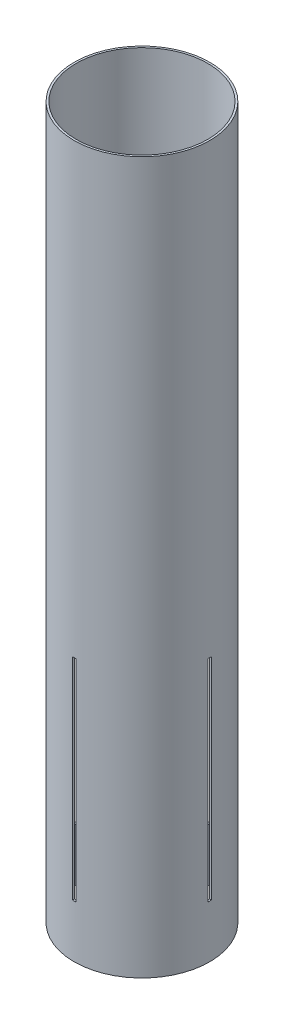
ISO-10303-21;
HEADER;
FILE_DESCRIPTION(('STEP AP214'),'2;1');
FILE_NAME('part.step','',(''),(''),'','','');
FILE_SCHEMA(('AUTOMOTIVE_DESIGN { 1 0 10303 214 1 1 1 1 }'));
ENDSEC;
DATA;
#1=APPLICATION_CONTEXT('core data for automotive mechanical design processes');
#2=APPLICATION_PROTOCOL_DEFINITION('international standard','automotive_design',2000,#1);
#3=PRODUCT_CONTEXT('',#1,'mechanical');
#4=PRODUCT('Part','Part','',(#3));
#5=PRODUCT_RELATED_PRODUCT_CATEGORY('part','',(#4));
#6=PRODUCT_DEFINITION_FORMATION('','',#4);
#7=PRODUCT_DEFINITION_CONTEXT('part definition',#1,'design');
#8=PRODUCT_DEFINITION('design','',#6,#7);
#9=PRODUCT_DEFINITION_SHAPE('','',#8);
#10=(LENGTH_UNIT() NAMED_UNIT(*) SI_UNIT(.MILLI.,.METRE.));
#11=(NAMED_UNIT(*) PLANE_ANGLE_UNIT() SI_UNIT($,.RADIAN.));
#12=(NAMED_UNIT(*) SI_UNIT($,.STERADIAN.) SOLID_ANGLE_UNIT());
#13=UNCERTAINTY_MEASURE_WITH_UNIT(LENGTH_MEASURE(1.E-05),#10,'distance_accuracy_value','');
#14=(GEOMETRIC_REPRESENTATION_CONTEXT(3) GLOBAL_UNCERTAINTY_ASSIGNED_CONTEXT((#13)) GLOBAL_UNIT_ASSIGNED_CONTEXT((#10,
#11,#12)) REPRESENTATION_CONTEXT('',''));
#15=CARTESIAN_POINT('',(0.,0.,0.));
#16=DIRECTION('',(0.,0.,1.));
#17=DIRECTION('',(1.,0.,0.));
#18=AXIS2_PLACEMENT_3D('',#15,#16,#17);
#19=CARTESIAN_POINT('',(0.,342.9,0.));
#20=DIRECTION('',(0.,-1.,0.));
#21=DIRECTION('',(0.,0.,-1.));
#22=AXIS2_PLACEMENT_3D('',#19,#20,#21);
#23=CYLINDRICAL_SURFACE('',#22,65.405);
#24=CARTESIAN_POINT('',(0.,-292.1,0.));
#25=DIRECTION('',(0.,-1.,0.));
#26=DIRECTION('',(0.,0.,-1.));
#27=AXIS2_PLACEMENT_3D('',#24,#25,#26);
#28=CIRCLE('',#27,65.405);
#29=CARTESIAN_POINT('',(-1.58750000000023,-292.1,-65.3857313849895));
#30=VERTEX_POINT('',#29);
#31=CARTESIAN_POINT('',(1.58749999999975,-292.1,-65.3857313849895));
#32=VERTEX_POINT('',#31);
#33=EDGE_CURVE('E258',#30,#32,#28,.T.);
#34=ORIENTED_EDGE('',*,*,#33,.T.);
#35=DIRECTION('',(0.,-1.,0.));
#36=VECTOR('',#35,1.);
#37=CARTESIAN_POINT('',(1.58749999999982,342.9,-65.3857313849895));
#38=LINE('',#37,#36);
#39=CARTESIAN_POINT('',(1.58749999999977,-88.9,-65.3857313849895));
#40=VERTEX_POINT('',#39);
#41=EDGE_CURVE('E262',#32,#40,#38,.F.);
#42=ORIENTED_EDGE('',*,*,#41,.T.);
#43=CARTESIAN_POINT('',(0.,-88.9,0.));
#44=DIRECTION('',(0.,-1.,0.));
#45=DIRECTION('',(0.,0.,-1.));
#46=AXIS2_PLACEMENT_3D('',#43,#44,#45);
#47=CIRCLE('',#46,65.405);
#48=CARTESIAN_POINT('',(-1.58750000000021,-88.9,-65.3857313849895));
#49=VERTEX_POINT('',#48);
#50=EDGE_CURVE('E251',#49,#40,#47,.T.);
#51=ORIENTED_EDGE('',*,*,#50,.F.);
#52=DIRECTION('',(0.,-1.,0.));
#53=VECTOR('',#52,1.);
#54=CARTESIAN_POINT('',(-1.58750000000015,342.9,-65.3857313849895));
#55=LINE('',#54,#53);
#56=EDGE_CURVE('E255',#30,#49,#55,.F.);
#57=ORIENTED_EDGE('',*,*,#56,.F.);
#58=EDGE_LOOP('',(#34,#42,#51,#57));
#59=FACE_BOUND('',#58,.T.);
#60=DIRECTION('',(0.,-1.,0.));
#61=VECTOR('',#60,1.);
#62=CARTESIAN_POINT('',(-65.3857313849895,342.9,1.58750000000005));
#63=LINE('',#62,#61);
#64=CARTESIAN_POINT('',(-65.3857313849895,-88.9,1.5875));
#65=VERTEX_POINT('',#64);
#66=CARTESIAN_POINT('',(-65.3857313849895,-292.1,1.58750000000005));
#67=VERTEX_POINT('',#66);
#68=EDGE_CURVE('E227',#65,#67,#63,.T.);
#69=ORIENTED_EDGE('',*,*,#68,.T.);
#70=CARTESIAN_POINT('',(0.,-292.1,0.));
#71=DIRECTION('',(0.,-1.,0.));
#72=DIRECTION('',(0.,0.,-1.));
#73=AXIS2_PLACEMENT_3D('',#70,#71,#72);
#74=CIRCLE('',#73,65.405);
#75=CARTESIAN_POINT('',(-65.3857313849895,-292.1,-1.5875));
#76=VERTEX_POINT('',#75);
#77=EDGE_CURVE('E226',#67,#76,#74,.T.);
#78=ORIENTED_EDGE('',*,*,#77,.T.);
#79=DIRECTION('',(0.,-1.,0.));
#80=VECTOR('',#79,1.);
#81=CARTESIAN_POINT('',(-65.3857313849895,342.9,-1.58749999999992));
#82=LINE('',#81,#80);
#83=CARTESIAN_POINT('',(-65.3857313849895,-88.9,-1.58749999999998));
#84=VERTEX_POINT('',#83);
#85=EDGE_CURVE('E219',#84,#76,#82,.T.);
#86=ORIENTED_EDGE('',*,*,#85,.F.);
#87=CARTESIAN_POINT('',(0.,-88.9,0.));
#88=DIRECTION('',(0.,-1.,0.));
#89=DIRECTION('',(0.,0.,-1.));
#90=AXIS2_PLACEMENT_3D('',#87,#88,#89);
#91=CIRCLE('',#90,65.405);
#92=EDGE_CURVE('E218',#65,#84,#91,.T.);
#93=ORIENTED_EDGE('',*,*,#92,.F.);
#94=EDGE_LOOP('',(#69,#78,#86,#93));
#95=FACE_BOUND('',#94,.T.);
#96=CARTESIAN_POINT('',(0.,342.9,0.));
#97=DIRECTION('',(0.,1.,0.));
#98=DIRECTION('',(0.,0.,1.));
#99=AXIS2_PLACEMENT_3D('',#96,#97,#98);
#100=CIRCLE('',#99,65.405);
#101=CARTESIAN_POINT('',(0.,342.9,65.405));
#102=VERTEX_POINT('',#101);
#103=EDGE_CURVE('E204',#102,#102,#100,.T.);
#104=ORIENTED_EDGE('',*,*,#103,.F.);
#105=EDGE_LOOP('',(#104));
#106=FACE_BOUND('',#105,.T.);
#107=CARTESIAN_POINT('',(0.,-342.9,0.));
#108=DIRECTION('',(0.,1.,0.));
#109=DIRECTION('',(0.,0.,1.));
#110=AXIS2_PLACEMENT_3D('',#107,#108,#109);
#111=CIRCLE('',#110,65.405);
#112=CARTESIAN_POINT('',(0.,-342.9,65.405));
#113=VERTEX_POINT('',#112);
#114=EDGE_CURVE('E205',#113,#113,#111,.T.);
#115=ORIENTED_EDGE('',*,*,#114,.T.);
#116=EDGE_LOOP('',(#115));
#117=FACE_BOUND('',#116,.T.);
#118=CARTESIAN_POINT('',(65.3857313849895,-88.9,-1.58749999999998));
#119=VERTEX_POINT('',#118);
#120=CARTESIAN_POINT('',(65.3857313849895,-88.9,1.5875));
#121=VERTEX_POINT('',#120);
#122=EDGE_CURVE('E214',#119,#121,#91,.T.);
#123=ORIENTED_EDGE('',*,*,#122,.F.);
#124=DIRECTION('',(0.,-1.,0.));
#125=VECTOR('',#124,1.);
#126=CARTESIAN_POINT('',(65.3857313849895,342.9,-1.58749999999992));
#127=LINE('',#126,#125);
#128=CARTESIAN_POINT('',(65.3857313849895,-292.1,-1.5875));
#129=VERTEX_POINT('',#128);
#130=EDGE_CURVE('E222',#129,#119,#127,.F.);
#131=ORIENTED_EDGE('',*,*,#130,.F.);
#132=CARTESIAN_POINT('',(65.3857313849895,-292.1,1.58749999999997));
#133=VERTEX_POINT('',#132);
#134=EDGE_CURVE('E224',#129,#133,#74,.T.);
#135=ORIENTED_EDGE('',*,*,#134,.T.);
#136=DIRECTION('',(0.,-1.,0.));
#137=VECTOR('',#136,1.);
#138=CARTESIAN_POINT('',(65.3857313849895,342.9,1.58750000000005));
#139=LINE('',#138,#137);
#140=EDGE_CURVE('E230',#133,#121,#139,.F.);
#141=ORIENTED_EDGE('',*,*,#140,.T.);
#142=EDGE_LOOP('',(#123,#131,#135,#141));
#143=FACE_BOUND('',#142,.T.);
#144=DIRECTION('',(0.,-1.,0.));
#145=VECTOR('',#144,1.);
#146=CARTESIAN_POINT('',(1.58750000000028,342.9,65.3857313849895));
#147=LINE('',#146,#145);
#148=CARTESIAN_POINT('',(1.58750000000023,-88.9,65.3857313849895));
#149=VERTEX_POINT('',#148);
#150=CARTESIAN_POINT('',(1.58750000000028,-292.1,65.3857313849895));
#151=VERTEX_POINT('',#150);
#152=EDGE_CURVE('E260',#149,#151,#147,.T.);
#153=ORIENTED_EDGE('',*,*,#152,.T.);
#154=CARTESIAN_POINT('',(-1.58749999999977,-292.1,65.3857313849895));
#155=VERTEX_POINT('',#154);
#156=EDGE_CURVE('E164',#151,#155,#28,.T.);
#157=ORIENTED_EDGE('',*,*,#156,.T.);
#158=DIRECTION('',(0.,-1.,0.));
#159=VECTOR('',#158,1.);
#160=CARTESIAN_POINT('',(-1.5874999999997,342.9,65.3857313849895));
#161=LINE('',#160,#159);
#162=CARTESIAN_POINT('',(-1.58749999999975,-88.9,65.3857313849895));
#163=VERTEX_POINT('',#162);
#164=EDGE_CURVE('E252',#163,#155,#161,.T.);
#165=ORIENTED_EDGE('',*,*,#164,.F.);
#166=EDGE_CURVE('E249',#149,#163,#47,.T.);
#167=ORIENTED_EDGE('',*,*,#166,.F.);
#168=EDGE_LOOP('',(#153,#157,#165,#167));
#169=FACE_BOUND('',#168,.T.);
#170=ADVANCED_FACE('F39',(#59,#95,#106,#117,#143,#169),#23,.T.);
#171=CARTESIAN_POINT('',(0.,342.9,0.));
#172=DIRECTION('',(0.,-1.,0.));
#173=DIRECTION('',(0.,0.,-1.));
#174=AXIS2_PLACEMENT_3D('',#171,#172,#173);
#175=CYLINDRICAL_SURFACE('',#174,63.5);
#176=CARTESIAN_POINT('',(0.,342.9,0.));
#177=DIRECTION('',(0.,1.,0.));
#178=DIRECTION('',(0.,0.,1.));
#179=AXIS2_PLACEMENT_3D('',#176,#177,#178);
#180=CIRCLE('',#179,63.5);
#181=CARTESIAN_POINT('',(0.,342.9,63.5));
#182=VERTEX_POINT('',#181);
#183=EDGE_CURVE('E208',#182,#182,#180,.T.);
#184=ORIENTED_EDGE('',*,*,#183,.T.);
#185=EDGE_LOOP('',(#184));
#186=FACE_BOUND('',#185,.T.);
#187=CARTESIAN_POINT('',(0.,-342.9,0.));
#188=DIRECTION('',(0.,1.,0.));
#189=DIRECTION('',(0.,0.,1.));
#190=AXIS2_PLACEMENT_3D('',#187,#188,#189);
#191=CIRCLE('',#190,63.5);
#192=CARTESIAN_POINT('',(0.,-342.9,63.5));
#193=VERTEX_POINT('',#192);
#194=EDGE_CURVE('E211',#193,#193,#191,.T.);
#195=ORIENTED_EDGE('',*,*,#194,.F.);
#196=EDGE_LOOP('',(#195));
#197=FACE_BOUND('',#196,.T.);
#198=DIRECTION('',(0.,-1.,0.));
#199=VECTOR('',#198,1.);
#200=CARTESIAN_POINT('',(63.4801531484448,342.9,-1.58749999999992));
#201=LINE('',#200,#199);
#202=CARTESIAN_POINT('',(63.4801531484448,-292.1,-1.5875));
#203=VERTEX_POINT('',#202);
#204=CARTESIAN_POINT('',(63.4801531484448,-88.9,-1.58749999999998));
#205=VERTEX_POINT('',#204);
#206=EDGE_CURVE('E196',#203,#205,#201,.F.);
#207=ORIENTED_EDGE('',*,*,#206,.T.);
#208=CARTESIAN_POINT('',(0.,-88.9,0.));
#209=DIRECTION('',(0.,-1.,0.));
#210=DIRECTION('',(0.,0.,-1.));
#211=AXIS2_PLACEMENT_3D('',#208,#209,#210);
#212=CIRCLE('',#211,63.5);
#213=CARTESIAN_POINT('',(63.4801531484448,-88.9,1.5875));
#214=VERTEX_POINT('',#213);
#215=EDGE_CURVE('E188',#205,#214,#212,.T.);
#216=ORIENTED_EDGE('',*,*,#215,.T.);
#217=DIRECTION('',(0.,-1.,0.));
#218=VECTOR('',#217,1.);
#219=CARTESIAN_POINT('',(63.4801531484448,342.9,1.58750000000005));
#220=LINE('',#219,#218);
#221=CARTESIAN_POINT('',(63.4801531484448,-292.1,1.58750000000005));
#222=VERTEX_POINT('',#221);
#223=EDGE_CURVE('E202',#222,#214,#220,.F.);
#224=ORIENTED_EDGE('',*,*,#223,.F.);
#225=CARTESIAN_POINT('',(0.,-292.1,0.));
#226=DIRECTION('',(0.,-1.,0.));
#227=DIRECTION('',(0.,0.,-1.));
#228=AXIS2_PLACEMENT_3D('',#225,#226,#227);
#229=CIRCLE('',#228,63.5);
#230=EDGE_CURVE('E199',#203,#222,#229,.T.);
#231=ORIENTED_EDGE('',*,*,#230,.F.);
#232=EDGE_LOOP('',(#207,#216,#224,#231));
#233=FACE_BOUND('',#232,.T.);
#234=DIRECTION('',(0.,-1.,0.));
#235=VECTOR('',#234,1.);
#236=CARTESIAN_POINT('',(-63.4801531484448,342.9,1.58750000000005));
#237=LINE('',#236,#235);
#238=CARTESIAN_POINT('',(-63.4801531484448,-88.8999999999999,1.58750000000005));
#239=VERTEX_POINT('',#238);
#240=CARTESIAN_POINT('',(-63.4801531484448,-292.1,1.58749999999997));
#241=VERTEX_POINT('',#240);
#242=EDGE_CURVE('E193',#239,#241,#237,.T.);
#243=ORIENTED_EDGE('',*,*,#242,.F.);
#244=CARTESIAN_POINT('',(-63.4801531484448,-88.9,-1.58749999999998));
#245=VERTEX_POINT('',#244);
#246=EDGE_CURVE('E184',#239,#245,#212,.T.);
#247=ORIENTED_EDGE('',*,*,#246,.T.);
#248=DIRECTION('',(0.,-1.,0.));
#249=VECTOR('',#248,1.);
#250=CARTESIAN_POINT('',(-63.4801531484448,342.9,-1.58749999999992));
#251=LINE('',#250,#249);
#252=CARTESIAN_POINT('',(-63.4801531484448,-292.1,-1.5875));
#253=VERTEX_POINT('',#252);
#254=EDGE_CURVE('E186',#245,#253,#251,.T.);
#255=ORIENTED_EDGE('',*,*,#254,.T.);
#256=EDGE_CURVE('E192',#241,#253,#229,.T.);
#257=ORIENTED_EDGE('',*,*,#256,.F.);
#258=EDGE_LOOP('',(#243,#247,#255,#257));
#259=FACE_BOUND('',#258,.T.);
#260=DIRECTION('',(0.,-1.,0.));
#261=VECTOR('',#260,1.);
#262=CARTESIAN_POINT('',(-1.58750000000015,342.9,-63.4801531484448));
#263=LINE('',#262,#261);
#264=CARTESIAN_POINT('',(-1.58750000000022,-292.1,-63.4801531484448));
#265=VERTEX_POINT('',#264);
#266=CARTESIAN_POINT('',(-1.5875000000002,-88.9,-63.4801531484448));
#267=VERTEX_POINT('',#266);
#268=EDGE_CURVE('E176',#265,#267,#263,.F.);
#269=ORIENTED_EDGE('',*,*,#268,.T.);
#270=CARTESIAN_POINT('',(0.,-88.9,0.));
#271=DIRECTION('',(0.,-1.,0.));
#272=DIRECTION('',(0.,0.,-1.));
#273=AXIS2_PLACEMENT_3D('',#270,#271,#272);
#274=CIRCLE('',#273,63.5);
#275=CARTESIAN_POINT('',(1.58749999999978,-88.9,-63.4801531484448));
#276=VERTEX_POINT('',#275);
#277=EDGE_CURVE('E48',#267,#276,#274,.T.);
#278=ORIENTED_EDGE('',*,*,#277,.T.);
#279=DIRECTION('',(0.,-1.,0.));
#280=VECTOR('',#279,1.);
#281=CARTESIAN_POINT('',(1.58749999999983,342.9,-63.4801531484448));
#282=LINE('',#281,#280);
#283=CARTESIAN_POINT('',(1.58749999999983,-292.1,-63.4801531484448));
#284=VERTEX_POINT('',#283);
#285=EDGE_CURVE('E177',#284,#276,#282,.F.);
#286=ORIENTED_EDGE('',*,*,#285,.F.);
#287=CARTESIAN_POINT('',(0.,-292.1,0.));
#288=DIRECTION('',(0.,-1.,0.));
#289=DIRECTION('',(0.,0.,-1.));
#290=AXIS2_PLACEMENT_3D('',#287,#288,#289);
#291=CIRCLE('',#290,63.5);
#292=EDGE_CURVE('E172',#265,#284,#291,.T.);
#293=ORIENTED_EDGE('',*,*,#292,.F.);
#294=EDGE_LOOP('',(#269,#278,#286,#293));
#295=FACE_BOUND('',#294,.T.);
#296=DIRECTION('',(0.,-1.,0.));
#297=VECTOR('',#296,1.);
#298=CARTESIAN_POINT('',(1.58750000000027,342.9,63.4801531484448));
#299=LINE('',#298,#297);
#300=CARTESIAN_POINT('',(1.58750000000027,-88.8999999999999,63.4801531484448));
#301=VERTEX_POINT('',#300);
#302=CARTESIAN_POINT('',(1.5875000000002,-292.1,63.4801531484448));
#303=VERTEX_POINT('',#302);
#304=EDGE_CURVE('E152',#301,#303,#299,.T.);
#305=ORIENTED_EDGE('',*,*,#304,.F.);
#306=CARTESIAN_POINT('',(-1.58749999999976,-88.9,63.4801531484448));
#307=VERTEX_POINT('',#306);
#308=EDGE_CURVE('E11',#301,#307,#274,.T.);
#309=ORIENTED_EDGE('',*,*,#308,.T.);
#310=DIRECTION('',(0.,-1.,0.));
#311=VECTOR('',#310,1.);
#312=CARTESIAN_POINT('',(-1.5874999999997,342.9,63.4801531484448));
#313=LINE('',#312,#311);
#314=CARTESIAN_POINT('',(-1.58749999999978,-292.1,63.4801531484448));
#315=VERTEX_POINT('',#314);
#316=EDGE_CURVE('E42',#307,#315,#313,.T.);
#317=ORIENTED_EDGE('',*,*,#316,.T.);
#318=EDGE_CURVE('E159',#303,#315,#291,.T.);
#319=ORIENTED_EDGE('',*,*,#318,.F.);
#320=EDGE_LOOP('',(#305,#309,#317,#319));
#321=FACE_BOUND('',#320,.T.);
#322=ADVANCED_FACE('F170',(#186,#197,#233,#259,#295,#321),#175,.F.);
#323=CARTESIAN_POINT('',(0.,342.9,0.));
#324=DIRECTION('',(0.,1.,0.));
#325=DIRECTION('',(0.,0.,1.));
#326=AXIS2_PLACEMENT_3D('',#323,#324,#325);
#327=PLANE('',#326);
#328=ORIENTED_EDGE('',*,*,#103,.T.);
#329=EDGE_LOOP('',(#328));
#330=FACE_BOUND('',#329,.T.);
#331=ORIENTED_EDGE('',*,*,#183,.F.);
#332=EDGE_LOOP('',(#331));
#333=FACE_BOUND('',#332,.T.);
#334=ADVANCED_FACE('F285',(#330,#333),#327,.T.);
#335=CARTESIAN_POINT('',(0.,-342.9,0.));
#336=DIRECTION('',(0.,1.,0.));
#337=DIRECTION('',(0.,0.,1.));
#338=AXIS2_PLACEMENT_3D('',#335,#336,#337);
#339=PLANE('',#338);
#340=ORIENTED_EDGE('',*,*,#114,.F.);
#341=EDGE_LOOP('',(#340));
#342=FACE_BOUND('',#341,.T.);
#343=ORIENTED_EDGE('',*,*,#194,.T.);
#344=EDGE_LOOP('',(#343));
#345=FACE_BOUND('',#344,.T.);
#346=ADVANCED_FACE('F292',(#342,#345),#339,.F.);
#347=CARTESIAN_POINT('',(-65.405,-88.9,1.5875));
#348=DIRECTION('',(0.,0.,1.));
#349=DIRECTION('',(0.,-1.,0.));
#350=AXIS2_PLACEMENT_3D('',#347,#348,#349);
#351=PLANE('',#350);
#352=DIRECTION('',(1.,0.,0.));
#353=VECTOR('',#352,1.);
#354=CARTESIAN_POINT('',(-65.405,-292.1,1.58749999999997));
#355=LINE('',#354,#353);
#356=EDGE_CURVE('E242',#222,#133,#355,.T.);
#357=ORIENTED_EDGE('',*,*,#356,.F.);
#358=ORIENTED_EDGE('',*,*,#223,.T.);
#359=DIRECTION('',(1.,0.,0.));
#360=VECTOR('',#359,1.);
#361=CARTESIAN_POINT('',(-65.405,-88.9,1.5875));
#362=LINE('',#361,#360);
#363=EDGE_CURVE('E246',#214,#121,#362,.T.);
#364=ORIENTED_EDGE('',*,*,#363,.T.);
#365=ORIENTED_EDGE('',*,*,#140,.F.);
#366=EDGE_LOOP('',(#357,#358,#364,#365));
#367=FACE_BOUND('',#366,.T.);
#368=ADVANCED_FACE('F300',(#367),#351,.F.);
#369=CARTESIAN_POINT('',(-65.405,-292.1,1.58749999999997));
#370=DIRECTION('',(0.,-1.,0.));
#371=DIRECTION('',(0.,0.,-1.));
#372=AXIS2_PLACEMENT_3D('',#369,#370,#371);
#373=PLANE('',#372);
#374=DIRECTION('',(1.,0.,0.));
#375=VECTOR('',#374,1.);
#376=CARTESIAN_POINT('',(-65.405,-292.1,-1.5875));
#377=LINE('',#376,#375);
#378=EDGE_CURVE('E238',#203,#129,#377,.T.);
#379=ORIENTED_EDGE('',*,*,#378,.F.);
#380=ORIENTED_EDGE('',*,*,#230,.T.);
#381=ORIENTED_EDGE('',*,*,#356,.T.);
#382=ORIENTED_EDGE('',*,*,#134,.F.);
#383=EDGE_LOOP('',(#379,#380,#381,#382));
#384=FACE_BOUND('',#383,.T.);
#385=ADVANCED_FACE('F305',(#384),#373,.F.);
#386=CARTESIAN_POINT('',(-65.405,-88.9,-1.58749999999998));
#387=DIRECTION('',(0.,0.,1.));
#388=DIRECTION('',(0.,-1.,0.));
#389=AXIS2_PLACEMENT_3D('',#386,#387,#388);
#390=PLANE('',#389);
#391=ORIENTED_EDGE('',*,*,#130,.T.);
#392=DIRECTION('',(1.,0.,0.));
#393=VECTOR('',#392,1.);
#394=CARTESIAN_POINT('',(-65.405,-88.9,-1.58749999999998));
#395=LINE('',#394,#393);
#396=EDGE_CURVE('E234',#205,#119,#395,.T.);
#397=ORIENTED_EDGE('',*,*,#396,.F.);
#398=ORIENTED_EDGE('',*,*,#206,.F.);
#399=ORIENTED_EDGE('',*,*,#378,.T.);
#400=EDGE_LOOP('',(#391,#397,#398,#399));
#401=FACE_BOUND('',#400,.T.);
#402=ADVANCED_FACE('F336',(#401),#390,.T.);
#403=CARTESIAN_POINT('',(-65.405,-88.9,1.5875));
#404=DIRECTION('',(0.,-1.,0.));
#405=DIRECTION('',(0.,0.,-1.));
#406=AXIS2_PLACEMENT_3D('',#403,#404,#405);
#407=PLANE('',#406);
#408=ORIENTED_EDGE('',*,*,#122,.T.);
#409=ORIENTED_EDGE('',*,*,#363,.F.);
#410=ORIENTED_EDGE('',*,*,#215,.F.);
#411=ORIENTED_EDGE('',*,*,#396,.T.);
#412=EDGE_LOOP('',(#408,#409,#410,#411));
#413=FACE_BOUND('',#412,.T.);
#414=ADVANCED_FACE('F297',(#413),#407,.T.);
#415=ORIENTED_EDGE('',*,*,#92,.T.);
#416=EDGE_CURVE('E233',#84,#245,#395,.T.);
#417=ORIENTED_EDGE('',*,*,#416,.T.);
#418=ORIENTED_EDGE('',*,*,#246,.F.);
#419=EDGE_CURVE('E245',#65,#239,#362,.T.);
#420=ORIENTED_EDGE('',*,*,#419,.F.);
#421=EDGE_LOOP('',(#415,#417,#418,#420));
#422=FACE_BOUND('',#421,.T.);
#423=ADVANCED_FACE('F330',(#422),#407,.T.);
#424=ORIENTED_EDGE('',*,*,#85,.T.);
#425=EDGE_CURVE('E237',#76,#253,#377,.T.);
#426=ORIENTED_EDGE('',*,*,#425,.T.);
#427=ORIENTED_EDGE('',*,*,#254,.F.);
#428=ORIENTED_EDGE('',*,*,#416,.F.);
#429=EDGE_LOOP('',(#424,#426,#427,#428));
#430=FACE_BOUND('',#429,.T.);
#431=ADVANCED_FACE('F334',(#430),#390,.T.);
#432=EDGE_CURVE('E241',#67,#241,#355,.T.);
#433=ORIENTED_EDGE('',*,*,#432,.T.);
#434=ORIENTED_EDGE('',*,*,#256,.T.);
#435=ORIENTED_EDGE('',*,*,#425,.F.);
#436=ORIENTED_EDGE('',*,*,#77,.F.);
#437=EDGE_LOOP('',(#433,#434,#435,#436));
#438=FACE_BOUND('',#437,.T.);
#439=ADVANCED_FACE('F323',(#438),#373,.F.);
#440=ORIENTED_EDGE('',*,*,#419,.T.);
#441=ORIENTED_EDGE('',*,*,#242,.T.);
#442=ORIENTED_EDGE('',*,*,#432,.F.);
#443=ORIENTED_EDGE('',*,*,#68,.F.);
#444=EDGE_LOOP('',(#440,#441,#442,#443));
#445=FACE_BOUND('',#444,.T.);
#446=ADVANCED_FACE('F308',(#445),#351,.F.);
#447=CARTESIAN_POINT('',(1.58750000000023,-88.9,65.4050000000002));
#448=DIRECTION('',(1.,0.,0.));
#449=DIRECTION('',(0.,0.,-1.));
#450=AXIS2_PLACEMENT_3D('',#447,#448,#449);
#451=PLANE('',#450);
#452=DIRECTION('',(0.,0.,-1.));
#453=VECTOR('',#452,1.);
#454=CARTESIAN_POINT('',(1.5875000000002,-292.1,65.4050000000002));
#455=LINE('',#454,#453);
#456=EDGE_CURVE('E167',#284,#32,#455,.T.);
#457=ORIENTED_EDGE('',*,*,#456,.F.);
#458=ORIENTED_EDGE('',*,*,#285,.T.);
#459=DIRECTION('',(0.,0.,-1.));
#460=VECTOR('',#459,1.);
#461=CARTESIAN_POINT('',(1.58750000000023,-88.9,65.4050000000002));
#462=LINE('',#461,#460);
#463=EDGE_CURVE('E63',#276,#40,#462,.T.);
#464=ORIENTED_EDGE('',*,*,#463,.T.);
#465=ORIENTED_EDGE('',*,*,#41,.F.);
#466=EDGE_LOOP('',(#457,#458,#464,#465));
#467=FACE_BOUND('',#466,.T.);
#468=ADVANCED_FACE('F273',(#467),#451,.F.);
#469=CARTESIAN_POINT('',(1.5875000000002,-292.1,65.4050000000002));
#470=DIRECTION('',(0.,-1.,0.));
#471=DIRECTION('',(0.,0.,-1.));
#472=AXIS2_PLACEMENT_3D('',#469,#470,#471);
#473=PLANE('',#472);
#474=ORIENTED_EDGE('',*,*,#33,.F.);
#475=DIRECTION('',(0.,0.,-1.));
#476=VECTOR('',#475,1.);
#477=CARTESIAN_POINT('',(-1.58749999999977,-292.1,65.4050000000002));
#478=LINE('',#477,#476);
#479=EDGE_CURVE('E166',#265,#30,#478,.T.);
#480=ORIENTED_EDGE('',*,*,#479,.F.);
#481=ORIENTED_EDGE('',*,*,#292,.T.);
#482=ORIENTED_EDGE('',*,*,#456,.T.);
#483=EDGE_LOOP('',(#474,#480,#481,#482));
#484=FACE_BOUND('',#483,.T.);
#485=ADVANCED_FACE('F272',(#484),#473,.F.);
#486=CARTESIAN_POINT('',(-1.58749999999975,-88.9,65.4050000000002));
#487=DIRECTION('',(1.,0.,0.));
#488=DIRECTION('',(0.,0.,-1.));
#489=AXIS2_PLACEMENT_3D('',#486,#487,#488);
#490=PLANE('',#489);
#491=ORIENTED_EDGE('',*,*,#56,.T.);
#492=DIRECTION('',(0.,0.,-1.));
#493=VECTOR('',#492,1.);
#494=CARTESIAN_POINT('',(-1.58749999999975,-88.9,65.4050000000002));
#495=LINE('',#494,#493);
#496=EDGE_CURVE('E266',#267,#49,#495,.T.);
#497=ORIENTED_EDGE('',*,*,#496,.F.);
#498=ORIENTED_EDGE('',*,*,#268,.F.);
#499=ORIENTED_EDGE('',*,*,#479,.T.);
#500=EDGE_LOOP('',(#491,#497,#498,#499));
#501=FACE_BOUND('',#500,.T.);
#502=ADVANCED_FACE('F279',(#501),#490,.T.);
#503=CARTESIAN_POINT('',(1.58750000000023,-88.9,65.4050000000002));
#504=DIRECTION('',(0.,-1.,0.));
#505=DIRECTION('',(0.,0.,-1.));
#506=AXIS2_PLACEMENT_3D('',#503,#504,#505);
#507=PLANE('',#506);
#508=ORIENTED_EDGE('',*,*,#50,.T.);
#509=ORIENTED_EDGE('',*,*,#463,.F.);
#510=ORIENTED_EDGE('',*,*,#277,.F.);
#511=ORIENTED_EDGE('',*,*,#496,.T.);
#512=EDGE_LOOP('',(#508,#509,#510,#511));
#513=FACE_BOUND('',#512,.T.);
#514=ADVANCED_FACE('F281',(#513),#507,.T.);
#515=ORIENTED_EDGE('',*,*,#166,.T.);
#516=EDGE_CURVE('E265',#163,#307,#495,.T.);
#517=ORIENTED_EDGE('',*,*,#516,.T.);
#518=ORIENTED_EDGE('',*,*,#308,.F.);
#519=EDGE_CURVE('E155',#149,#301,#462,.T.);
#520=ORIENTED_EDGE('',*,*,#519,.F.);
#521=EDGE_LOOP('',(#515,#517,#518,#520));
#522=FACE_BOUND('',#521,.T.);
#523=ADVANCED_FACE('F362',(#522),#507,.T.);
#524=ORIENTED_EDGE('',*,*,#164,.T.);
#525=EDGE_CURVE('E269',#155,#315,#478,.T.);
#526=ORIENTED_EDGE('',*,*,#525,.T.);
#527=ORIENTED_EDGE('',*,*,#316,.F.);
#528=ORIENTED_EDGE('',*,*,#516,.F.);
#529=EDGE_LOOP('',(#524,#526,#527,#528));
#530=FACE_BOUND('',#529,.T.);
#531=ADVANCED_FACE('F366',(#530),#490,.T.);
#532=EDGE_CURVE('E55',#151,#303,#455,.T.);
#533=ORIENTED_EDGE('',*,*,#532,.T.);
#534=ORIENTED_EDGE('',*,*,#318,.T.);
#535=ORIENTED_EDGE('',*,*,#525,.F.);
#536=ORIENTED_EDGE('',*,*,#156,.F.);
#537=EDGE_LOOP('',(#533,#534,#535,#536));
#538=FACE_BOUND('',#537,.T.);
#539=ADVANCED_FACE('F161',(#538),#473,.F.);
#540=ORIENTED_EDGE('',*,*,#519,.T.);
#541=ORIENTED_EDGE('',*,*,#304,.T.);
#542=ORIENTED_EDGE('',*,*,#532,.F.);
#543=ORIENTED_EDGE('',*,*,#152,.F.);
#544=EDGE_LOOP('',(#540,#541,#542,#543));
#545=FACE_BOUND('',#544,.T.);
#546=ADVANCED_FACE('F153',(#545),#451,.F.);
#547=CLOSED_SHELL('',(#170,#322,#334,#346,#368,#385,#402,#414,#423,#431,#439,#446,#468,#485,
#502,#514,#523,#531,#539,#546));
#548=MANIFOLD_SOLID_BREP('B2',#547);
#549=ADVANCED_BREP_SHAPE_REPRESENTATION('',(#18,#548),#14);
#550=SHAPE_DEFINITION_REPRESENTATION(#9,#549);
ENDSEC;
END-ISO-10303-21;
